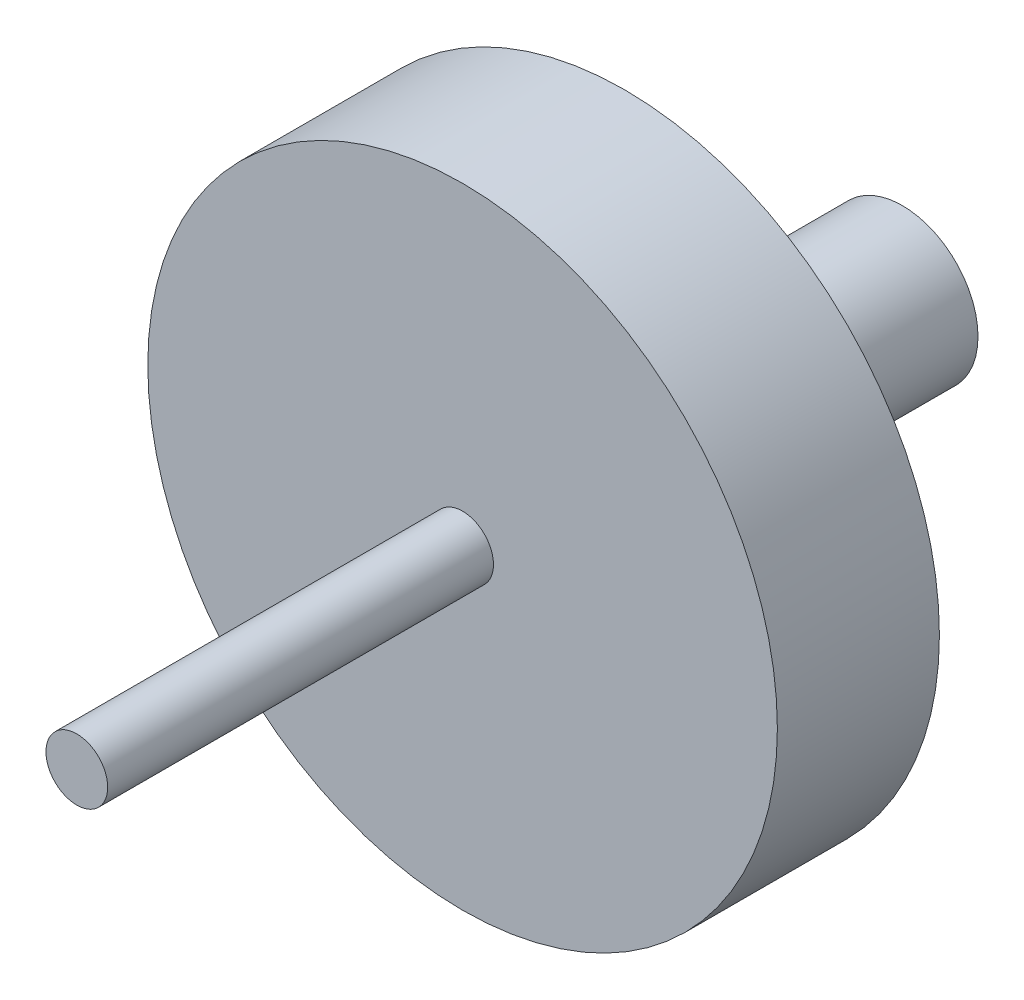
ISO-10303-21;
HEADER;
FILE_DESCRIPTION(('STEP AP214'),'2;1');
FILE_NAME('part.step','',(''),(''),'','','');
FILE_SCHEMA(('AUTOMOTIVE_DESIGN { 1 0 10303 214 1 1 1 1 }'));
ENDSEC;
DATA;
#1=APPLICATION_CONTEXT('core data for automotive mechanical design processes');
#2=APPLICATION_PROTOCOL_DEFINITION('international standard','automotive_design',2000,#1);
#3=PRODUCT_CONTEXT('',#1,'mechanical');
#4=PRODUCT('Part','Part','',(#3));
#5=PRODUCT_RELATED_PRODUCT_CATEGORY('part','',(#4));
#6=PRODUCT_DEFINITION_FORMATION('','',#4);
#7=PRODUCT_DEFINITION_CONTEXT('part definition',#1,'design');
#8=PRODUCT_DEFINITION('design','',#6,#7);
#9=PRODUCT_DEFINITION_SHAPE('','',#8);
#10=(LENGTH_UNIT() NAMED_UNIT(*) SI_UNIT(.MILLI.,.METRE.));
#11=(NAMED_UNIT(*) PLANE_ANGLE_UNIT() SI_UNIT($,.RADIAN.));
#12=(NAMED_UNIT(*) SI_UNIT($,.STERADIAN.) SOLID_ANGLE_UNIT());
#13=UNCERTAINTY_MEASURE_WITH_UNIT(LENGTH_MEASURE(1.E-05),#10,'distance_accuracy_value','');
#14=(GEOMETRIC_REPRESENTATION_CONTEXT(3) GLOBAL_UNCERTAINTY_ASSIGNED_CONTEXT((#13)) GLOBAL_UNIT_ASSIGNED_CONTEXT((#10,
#11,#12)) REPRESENTATION_CONTEXT('',''));
#15=CARTESIAN_POINT('',(0.,0.,0.));
#16=DIRECTION('',(0.,0.,1.));
#17=DIRECTION('',(1.,0.,0.));
#18=AXIS2_PLACEMENT_3D('',#15,#16,#17);
#19=CARTESIAN_POINT('',(0.,0.,0.));
#20=DIRECTION('',(0.,0.,1.));
#21=DIRECTION('',(1.,0.,0.));
#22=AXIS2_PLACEMENT_3D('',#19,#20,#21);
#23=CYLINDRICAL_SURFACE('',#22,4.9);
#24=CARTESIAN_POINT('',(0.,0.,0.));
#25=DIRECTION('',(0.,0.,1.));
#26=DIRECTION('',(1.,0.,0.));
#27=AXIS2_PLACEMENT_3D('',#24,#25,#26);
#28=CIRCLE('',#27,4.9);
#29=CARTESIAN_POINT('',(4.9,0.,0.));
#30=VERTEX_POINT('',#29);
#31=EDGE_CURVE('E10',#30,#30,#28,.T.);
#32=ORIENTED_EDGE('',*,*,#31,.T.);
#33=EDGE_LOOP('',(#32));
#34=FACE_BOUND('',#33,.T.);
#35=CARTESIAN_POINT('',(0.,0.,18.));
#36=DIRECTION('',(0.,0.,1.));
#37=DIRECTION('',(1.,0.,0.));
#38=AXIS2_PLACEMENT_3D('',#35,#36,#37);
#39=CIRCLE('',#38,4.9);
#40=CARTESIAN_POINT('',(4.9,0.,18.));
#41=VERTEX_POINT('',#40);
#42=EDGE_CURVE('E50',#41,#41,#39,.T.);
#43=ORIENTED_EDGE('',*,*,#42,.F.);
#44=EDGE_LOOP('',(#43));
#45=FACE_BOUND('',#44,.T.);
#46=ADVANCED_FACE('F28',(#34,#45),#23,.T.);
#47=CARTESIAN_POINT('',(4.9,0.,0.));
#48=DIRECTION('',(0.,0.,-1.));
#49=DIRECTION('',(-1.,0.,0.));
#50=AXIS2_PLACEMENT_3D('',#47,#48,#49);
#51=PLANE('',#50);
#52=ORIENTED_EDGE('',*,*,#31,.F.);
#53=EDGE_LOOP('',(#52));
#54=FACE_BOUND('',#53,.T.);
#55=ADVANCED_FACE('F58',(#54),#51,.T.);
#56=CARTESIAN_POINT('',(0.,0.,53.5));
#57=DIRECTION('',(0.,0.,1.));
#58=DIRECTION('',(1.,0.,0.));
#59=AXIS2_PLACEMENT_3D('',#56,#57,#58);
#60=PLANE('',#59);
#61=CARTESIAN_POINT('',(0.,0.,53.5));
#62=DIRECTION('',(0.,0.,1.));
#63=DIRECTION('',(1.,0.,0.));
#64=AXIS2_PLACEMENT_3D('',#61,#62,#63);
#65=CIRCLE('',#64,2.);
#66=CARTESIAN_POINT('',(2.,0.,53.5));
#67=VERTEX_POINT('',#66);
#68=EDGE_CURVE('E34',#67,#67,#65,.T.);
#69=ORIENTED_EDGE('',*,*,#68,.T.);
#70=EDGE_LOOP('',(#69));
#71=FACE_BOUND('',#70,.T.);
#72=ADVANCED_FACE('F62',(#71),#60,.T.);
#73=CARTESIAN_POINT('',(0.,0.,0.));
#74=DIRECTION('',(0.,0.,1.));
#75=DIRECTION('',(1.,0.,0.));
#76=AXIS2_PLACEMENT_3D('',#73,#74,#75);
#77=CYLINDRICAL_SURFACE('',#76,2.);
#78=CARTESIAN_POINT('',(0.,0.,28.5));
#79=DIRECTION('',(0.,0.,1.));
#80=DIRECTION('',(1.,0.,0.));
#81=AXIS2_PLACEMENT_3D('',#78,#79,#80);
#82=CIRCLE('',#81,2.);
#83=CARTESIAN_POINT('',(2.,0.,28.5));
#84=VERTEX_POINT('',#83);
#85=EDGE_CURVE('E38',#84,#84,#82,.T.);
#86=ORIENTED_EDGE('',*,*,#85,.T.);
#87=EDGE_LOOP('',(#86));
#88=FACE_BOUND('',#87,.T.);
#89=ORIENTED_EDGE('',*,*,#68,.F.);
#90=EDGE_LOOP('',(#89));
#91=FACE_BOUND('',#90,.T.);
#92=ADVANCED_FACE('F67',(#88,#91),#77,.T.);
#93=CARTESIAN_POINT('',(2.,0.,28.5));
#94=DIRECTION('',(0.,0.,1.));
#95=DIRECTION('',(1.,0.,0.));
#96=AXIS2_PLACEMENT_3D('',#93,#94,#95);
#97=PLANE('',#96);
#98=CARTESIAN_POINT('',(0.,0.,28.5));
#99=DIRECTION('',(0.,0.,1.));
#100=DIRECTION('',(1.,0.,0.));
#101=AXIS2_PLACEMENT_3D('',#98,#99,#100);
#102=CIRCLE('',#101,20.4);
#103=CARTESIAN_POINT('',(20.4,0.,28.5));
#104=VERTEX_POINT('',#103);
#105=EDGE_CURVE('E42',#104,#104,#102,.T.);
#106=ORIENTED_EDGE('',*,*,#105,.T.);
#107=EDGE_LOOP('',(#106));
#108=FACE_BOUND('',#107,.T.);
#109=ORIENTED_EDGE('',*,*,#85,.F.);
#110=EDGE_LOOP('',(#109));
#111=FACE_BOUND('',#110,.T.);
#112=ADVANCED_FACE('F72',(#108,#111),#97,.T.);
#113=CARTESIAN_POINT('',(0.,0.,0.));
#114=DIRECTION('',(0.,0.,1.));
#115=DIRECTION('',(1.,0.,0.));
#116=AXIS2_PLACEMENT_3D('',#113,#114,#115);
#117=CYLINDRICAL_SURFACE('',#116,20.4);
#118=CARTESIAN_POINT('',(0.,0.,18.));
#119=DIRECTION('',(0.,0.,1.));
#120=DIRECTION('',(1.,0.,0.));
#121=AXIS2_PLACEMENT_3D('',#118,#119,#120);
#122=CIRCLE('',#121,20.4);
#123=CARTESIAN_POINT('',(20.4,0.,18.));
#124=VERTEX_POINT('',#123);
#125=EDGE_CURVE('E47',#124,#124,#122,.T.);
#126=ORIENTED_EDGE('',*,*,#125,.T.);
#127=EDGE_LOOP('',(#126));
#128=FACE_BOUND('',#127,.T.);
#129=ORIENTED_EDGE('',*,*,#105,.F.);
#130=EDGE_LOOP('',(#129));
#131=FACE_BOUND('',#130,.T.);
#132=ADVANCED_FACE('F76',(#128,#131),#117,.T.);
#133=CARTESIAN_POINT('',(20.4,0.,18.));
#134=DIRECTION('',(0.,0.,-1.));
#135=DIRECTION('',(-1.,0.,0.));
#136=AXIS2_PLACEMENT_3D('',#133,#134,#135);
#137=PLANE('',#136);
#138=ORIENTED_EDGE('',*,*,#42,.T.);
#139=EDGE_LOOP('',(#138));
#140=FACE_BOUND('',#139,.T.);
#141=ORIENTED_EDGE('',*,*,#125,.F.);
#142=EDGE_LOOP('',(#141));
#143=FACE_BOUND('',#142,.T.);
#144=ADVANCED_FACE('F54',(#140,#143),#137,.T.);
#145=CLOSED_SHELL('',(#46,#55,#72,#92,#112,#132,#144));
#146=MANIFOLD_SOLID_BREP('B2',#145);
#147=ADVANCED_BREP_SHAPE_REPRESENTATION('',(#18,#146),#14);
#148=SHAPE_DEFINITION_REPRESENTATION(#9,#147);
ENDSEC;
END-ISO-10303-21;
